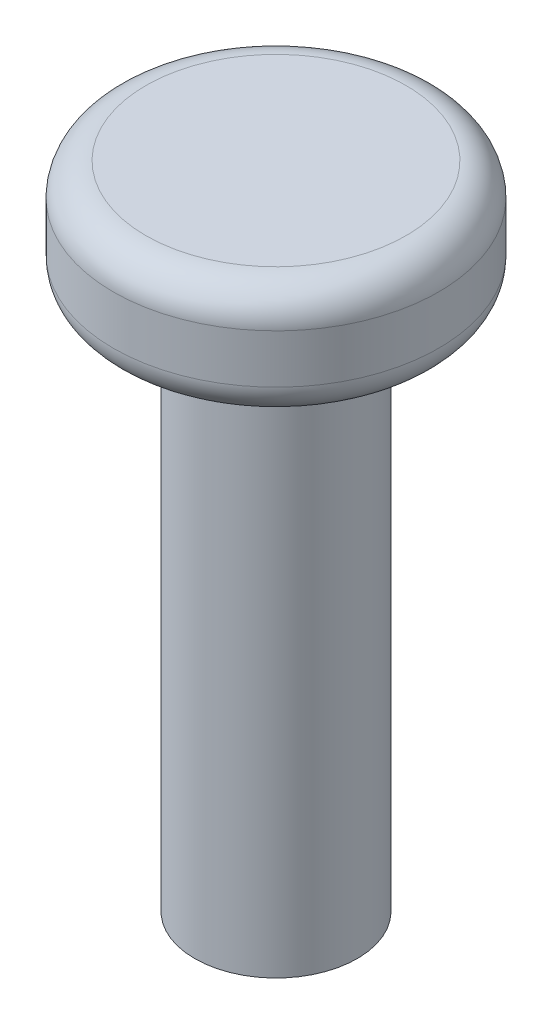
ISO-10303-21;
HEADER;
FILE_DESCRIPTION(('STEP AP214'),'2;1');
FILE_NAME('part.step','',(''),(''),'','','');
FILE_SCHEMA(('AUTOMOTIVE_DESIGN { 1 0 10303 214 1 1 1 1 }'));
ENDSEC;
DATA;
#1=APPLICATION_CONTEXT('core data for automotive mechanical design processes');
#2=APPLICATION_PROTOCOL_DEFINITION('international standard','automotive_design',2000,#1);
#3=PRODUCT_CONTEXT('',#1,'mechanical');
#4=PRODUCT('Part','Part','',(#3));
#5=PRODUCT_RELATED_PRODUCT_CATEGORY('part','',(#4));
#6=PRODUCT_DEFINITION_FORMATION('','',#4);
#7=PRODUCT_DEFINITION_CONTEXT('part definition',#1,'design');
#8=PRODUCT_DEFINITION('design','',#6,#7);
#9=PRODUCT_DEFINITION_SHAPE('','',#8);
#10=(LENGTH_UNIT() NAMED_UNIT(*) SI_UNIT(.MILLI.,.METRE.));
#11=(NAMED_UNIT(*) PLANE_ANGLE_UNIT() SI_UNIT($,.RADIAN.));
#12=(NAMED_UNIT(*) SI_UNIT($,.STERADIAN.) SOLID_ANGLE_UNIT());
#13=UNCERTAINTY_MEASURE_WITH_UNIT(LENGTH_MEASURE(1.E-05),#10,'distance_accuracy_value','');
#14=(GEOMETRIC_REPRESENTATION_CONTEXT(3) GLOBAL_UNCERTAINTY_ASSIGNED_CONTEXT((#13)) GLOBAL_UNIT_ASSIGNED_CONTEXT((#10,
#11,#12)) REPRESENTATION_CONTEXT('',''));
#15=CARTESIAN_POINT('',(0.,0.,0.));
#16=DIRECTION('',(0.,0.,1.));
#17=DIRECTION('',(1.,0.,0.));
#18=AXIS2_PLACEMENT_3D('',#15,#16,#17);
#19=CARTESIAN_POINT('',(0.,10.,0.));
#20=DIRECTION('',(0.,-1.,0.));
#21=DIRECTION('',(0.,0.,-1.));
#22=AXIS2_PLACEMENT_3D('',#19,#20,#21);
#23=CYLINDRICAL_SURFACE('',#22,2.5);
#24=CARTESIAN_POINT('',(0.,-10.,0.));
#25=DIRECTION('',(0.,1.,0.));
#26=DIRECTION('',(0.,0.,1.));
#27=AXIS2_PLACEMENT_3D('',#24,#25,#26);
#28=CIRCLE('',#27,2.5);
#29=CARTESIAN_POINT('',(0.,-10.,2.5));
#30=VERTEX_POINT('',#29);
#31=EDGE_CURVE('E97',#30,#30,#28,.T.);
#32=ORIENTED_EDGE('',*,*,#31,.T.);
#33=EDGE_LOOP('',(#32));
#34=FACE_BOUND('',#33,.T.);
#35=CARTESIAN_POINT('',(0.,6.5,0.));
#36=DIRECTION('',(0.,1.,0.));
#37=DIRECTION('',(0.,0.,1.));
#38=AXIS2_PLACEMENT_3D('',#35,#36,#37);
#39=CIRCLE('',#38,2.5);
#40=CARTESIAN_POINT('',(0.,6.5,2.5));
#41=VERTEX_POINT('',#40);
#42=EDGE_CURVE('E101',#41,#41,#39,.T.);
#43=ORIENTED_EDGE('',*,*,#42,.F.);
#44=EDGE_LOOP('',(#43));
#45=FACE_BOUND('',#44,.T.);
#46=ADVANCED_FACE('F39',(#34,#45),#23,.T.);
#47=CARTESIAN_POINT('',(1.,10.,-0.625));
#48=DIRECTION('',(-1.,0.,0.));
#49=DIRECTION('',(0.,0.,1.));
#50=AXIS2_PLACEMENT_3D('',#47,#48,#49);
#51=PLANE('',#50);
#52=DIRECTION('',(0.,-1.,0.));
#53=VECTOR('',#52,1.);
#54=CARTESIAN_POINT('',(1.,10.,0.625));
#55=LINE('',#54,#53);
#56=CARTESIAN_POINT('',(1.,-6.,0.625));
#57=VERTEX_POINT('',#56);
#58=CARTESIAN_POINT('',(1.,-10.,0.625));
#59=VERTEX_POINT('',#58);
#60=EDGE_CURVE('E61',#57,#59,#55,.T.);
#61=ORIENTED_EDGE('',*,*,#60,.F.);
#62=DIRECTION('',(0.,0.,-1.));
#63=VECTOR('',#62,1.);
#64=CARTESIAN_POINT('',(1.,-6.,0.625));
#65=LINE('',#64,#63);
#66=CARTESIAN_POINT('',(1.,-6.,-0.625));
#67=VERTEX_POINT('',#66);
#68=EDGE_CURVE('E54',#57,#67,#65,.T.);
#69=ORIENTED_EDGE('',*,*,#68,.T.);
#70=DIRECTION('',(0.,-1.,0.));
#71=VECTOR('',#70,1.);
#72=CARTESIAN_POINT('',(1.,10.,-0.625));
#73=LINE('',#72,#71);
#74=CARTESIAN_POINT('',(1.,-10.,-0.625));
#75=VERTEX_POINT('',#74);
#76=EDGE_CURVE('E89',#67,#75,#73,.T.);
#77=ORIENTED_EDGE('',*,*,#76,.T.);
#78=DIRECTION('',(0.,0.,-1.));
#79=VECTOR('',#78,1.);
#80=CARTESIAN_POINT('',(1.,-10.,-0.625));
#81=LINE('',#80,#79);
#82=EDGE_CURVE('E251',#59,#75,#81,.T.);
#83=ORIENTED_EDGE('',*,*,#82,.F.);
#84=EDGE_LOOP('',(#61,#69,#77,#83));
#85=FACE_BOUND('',#84,.T.);
#86=ADVANCED_FACE('F88',(#85),#51,.T.);
#87=CARTESIAN_POINT('',(-1.,10.,-0.625));
#88=DIRECTION('',(0.,0.,1.));
#89=DIRECTION('',(1.,0.,0.));
#90=AXIS2_PLACEMENT_3D('',#87,#88,#89);
#91=PLANE('',#90);
#92=ORIENTED_EDGE('',*,*,#76,.F.);
#93=DIRECTION('',(-1.,0.,0.));
#94=VECTOR('',#93,1.);
#95=CARTESIAN_POINT('',(1.,-6.,-0.625));
#96=LINE('',#95,#94);
#97=CARTESIAN_POINT('',(-1.,-6.,-0.625));
#98=VERTEX_POINT('',#97);
#99=EDGE_CURVE('E79',#67,#98,#96,.T.);
#100=ORIENTED_EDGE('',*,*,#99,.T.);
#101=DIRECTION('',(0.,-1.,0.));
#102=VECTOR('',#101,1.);
#103=CARTESIAN_POINT('',(-1.,10.,-0.625));
#104=LINE('',#103,#102);
#105=CARTESIAN_POINT('',(-1.,-10.,-0.625));
#106=VERTEX_POINT('',#105);
#107=EDGE_CURVE('E98',#98,#106,#104,.T.);
#108=ORIENTED_EDGE('',*,*,#107,.T.);
#109=DIRECTION('',(-1.,0.,0.));
#110=VECTOR('',#109,1.);
#111=CARTESIAN_POINT('',(-1.,-10.,-0.625));
#112=LINE('',#111,#110);
#113=EDGE_CURVE('E95',#75,#106,#112,.T.);
#114=ORIENTED_EDGE('',*,*,#113,.F.);
#115=EDGE_LOOP('',(#92,#100,#108,#114));
#116=FACE_BOUND('',#115,.T.);
#117=ADVANCED_FACE('F93',(#116),#91,.T.);
#118=CARTESIAN_POINT('',(-1.,10.,-0.625));
#119=DIRECTION('',(1.,0.,0.));
#120=DIRECTION('',(0.,0.,-1.));
#121=AXIS2_PLACEMENT_3D('',#118,#119,#120);
#122=PLANE('',#121);
#123=ORIENTED_EDGE('',*,*,#107,.F.);
#124=DIRECTION('',(0.,0.,1.));
#125=VECTOR('',#124,1.);
#126=CARTESIAN_POINT('',(-1.,-6.,-0.625));
#127=LINE('',#126,#125);
#128=CARTESIAN_POINT('',(-1.,-6.,0.625));
#129=VERTEX_POINT('',#128);
#130=EDGE_CURVE('E82',#98,#129,#127,.T.);
#131=ORIENTED_EDGE('',*,*,#130,.T.);
#132=DIRECTION('',(0.,-1.,0.));
#133=VECTOR('',#132,1.);
#134=CARTESIAN_POINT('',(-1.,10.,0.625));
#135=LINE('',#134,#133);
#136=CARTESIAN_POINT('',(-1.,-10.,0.625));
#137=VERTEX_POINT('',#136);
#138=EDGE_CURVE('E103',#129,#137,#135,.T.);
#139=ORIENTED_EDGE('',*,*,#138,.T.);
#140=DIRECTION('',(0.,0.,1.));
#141=VECTOR('',#140,1.);
#142=CARTESIAN_POINT('',(-1.,-10.,-0.625));
#143=LINE('',#142,#141);
#144=EDGE_CURVE('E248',#106,#137,#143,.T.);
#145=ORIENTED_EDGE('',*,*,#144,.F.);
#146=EDGE_LOOP('',(#123,#131,#139,#145));
#147=FACE_BOUND('',#146,.T.);
#148=ADVANCED_FACE('F148',(#147),#122,.T.);
#149=CARTESIAN_POINT('',(-1.,10.,0.625));
#150=DIRECTION('',(0.,0.,-1.));
#151=DIRECTION('',(-1.,0.,0.));
#152=AXIS2_PLACEMENT_3D('',#149,#150,#151);
#153=PLANE('',#152);
#154=ORIENTED_EDGE('',*,*,#138,.F.);
#155=DIRECTION('',(1.,0.,0.));
#156=VECTOR('',#155,1.);
#157=CARTESIAN_POINT('',(-1.,-6.,0.625));
#158=LINE('',#157,#156);
#159=EDGE_CURVE('E91',#129,#57,#158,.T.);
#160=ORIENTED_EDGE('',*,*,#159,.T.);
#161=ORIENTED_EDGE('',*,*,#60,.T.);
#162=DIRECTION('',(1.,0.,0.));
#163=VECTOR('',#162,1.);
#164=CARTESIAN_POINT('',(-1.,-10.,0.625));
#165=LINE('',#164,#163);
#166=EDGE_CURVE('E242',#137,#59,#165,.T.);
#167=ORIENTED_EDGE('',*,*,#166,.F.);
#168=EDGE_LOOP('',(#154,#160,#161,#167));
#169=FACE_BOUND('',#168,.T.);
#170=ADVANCED_FACE('F142',(#169),#153,.T.);
#171=CARTESIAN_POINT('',(0.,-10.,0.));
#172=DIRECTION('',(0.,1.,0.));
#173=DIRECTION('',(0.,0.,1.));
#174=AXIS2_PLACEMENT_3D('',#171,#172,#173);
#175=PLANE('',#174);
#176=ORIENTED_EDGE('',*,*,#31,.F.);
#177=EDGE_LOOP('',(#176));
#178=FACE_BOUND('',#177,.T.);
#179=ORIENTED_EDGE('',*,*,#82,.T.);
#180=ORIENTED_EDGE('',*,*,#113,.T.);
#181=ORIENTED_EDGE('',*,*,#144,.T.);
#182=ORIENTED_EDGE('',*,*,#166,.T.);
#183=EDGE_LOOP('',(#179,#180,#181,#182));
#184=FACE_BOUND('',#183,.T.);
#185=ADVANCED_FACE('F139',(#178,#184),#175,.F.);
#186=CARTESIAN_POINT('',(0.,-6.,0.));
#187=DIRECTION('',(0.,1.,0.));
#188=DIRECTION('',(0.,0.,1.));
#189=AXIS2_PLACEMENT_3D('',#186,#187,#188);
#190=PLANE('',#189);
#191=ORIENTED_EDGE('',*,*,#159,.F.);
#192=ORIENTED_EDGE('',*,*,#130,.F.);
#193=ORIENTED_EDGE('',*,*,#99,.F.);
#194=ORIENTED_EDGE('',*,*,#68,.F.);
#195=EDGE_LOOP('',(#191,#192,#193,#194));
#196=FACE_BOUND('',#195,.T.);
#197=ADVANCED_FACE('F80',(#196),#190,.F.);
#198=CARTESIAN_POINT('',(0.,6.5,0.));
#199=DIRECTION('',(0.,1.,0.));
#200=DIRECTION('',(0.,0.,1.));
#201=AXIS2_PLACEMENT_3D('',#198,#199,#200);
#202=CYLINDRICAL_SURFACE('',#201,5.);
#203=CARTESIAN_POINT('',(0.,9.,0.));
#204=DIRECTION('',(0.,1.,0.));
#205=DIRECTION('',(0.,0.,1.));
#206=AXIS2_PLACEMENT_3D('',#203,#204,#205);
#207=CIRCLE('',#206,5.);
#208=CARTESIAN_POINT('',(0.,9.,5.));
#209=VERTEX_POINT('',#208);
#210=EDGE_CURVE('E11',#209,#209,#207,.F.);
#211=ORIENTED_EDGE('',*,*,#210,.T.);
#212=EDGE_LOOP('',(#211));
#213=FACE_BOUND('',#212,.T.);
#214=CARTESIAN_POINT('',(0.,7.5,0.));
#215=DIRECTION('',(0.,1.,0.));
#216=DIRECTION('',(0.,0.,1.));
#217=AXIS2_PLACEMENT_3D('',#214,#215,#216);
#218=CIRCLE('',#217,5.);
#219=CARTESIAN_POINT('',(0.,7.5,5.));
#220=VERTEX_POINT('',#219);
#221=EDGE_CURVE('E109',#220,#220,#218,.T.);
#222=ORIENTED_EDGE('',*,*,#221,.T.);
#223=EDGE_LOOP('',(#222));
#224=FACE_BOUND('',#223,.T.);
#225=ADVANCED_FACE('F155',(#213,#224),#202,.T.);
#226=CARTESIAN_POINT('',(0.,6.5,0.));
#227=DIRECTION('',(0.,1.,0.));
#228=DIRECTION('',(0.,0.,1.));
#229=AXIS2_PLACEMENT_3D('',#226,#227,#228);
#230=PLANE('',#229);
#231=CARTESIAN_POINT('',(0.,6.5,0.));
#232=DIRECTION('',(0.,1.,0.));
#233=DIRECTION('',(0.,0.,1.));
#234=AXIS2_PLACEMENT_3D('',#231,#232,#233);
#235=CIRCLE('',#234,4.);
#236=CARTESIAN_POINT('',(0.,6.5,4.));
#237=VERTEX_POINT('',#236);
#238=EDGE_CURVE('E112',#237,#237,#235,.F.);
#239=ORIENTED_EDGE('',*,*,#238,.T.);
#240=EDGE_LOOP('',(#239));
#241=FACE_BOUND('',#240,.T.);
#242=ORIENTED_EDGE('',*,*,#42,.T.);
#243=EDGE_LOOP('',(#242));
#244=FACE_BOUND('',#243,.T.);
#245=ADVANCED_FACE('F144',(#241,#244),#230,.F.);
#246=CARTESIAN_POINT('',(0.,10.,0.));
#247=DIRECTION('',(0.,1.,0.));
#248=DIRECTION('',(0.,0.,1.));
#249=AXIS2_PLACEMENT_3D('',#246,#247,#248);
#250=PLANE('',#249);
#251=CARTESIAN_POINT('',(0.,10.,0.));
#252=DIRECTION('',(0.,1.,0.));
#253=DIRECTION('',(0.,0.,1.));
#254=AXIS2_PLACEMENT_3D('',#251,#252,#253);
#255=CIRCLE('',#254,4.);
#256=CARTESIAN_POINT('',(0.,10.,4.));
#257=VERTEX_POINT('',#256);
#258=EDGE_CURVE('E47',#257,#257,#255,.T.);
#259=ORIENTED_EDGE('',*,*,#258,.T.);
#260=EDGE_LOOP('',(#259));
#261=FACE_BOUND('',#260,.T.);
#262=ADVANCED_FACE('F117',(#261),#250,.T.);
#263=CARTESIAN_POINT('',(0.,7.5,0.));
#264=DIRECTION('',(0.,1.,0.));
#265=DIRECTION('',(0.,0.,1.));
#266=AXIS2_PLACEMENT_3D('',#263,#264,#265);
#267=TOROIDAL_SURFACE('',#266,4.,1.);
#268=ORIENTED_EDGE('',*,*,#238,.F.);
#269=EDGE_LOOP('',(#268));
#270=FACE_BOUND('',#269,.T.);
#271=ORIENTED_EDGE('',*,*,#221,.F.);
#272=EDGE_LOOP('',(#271));
#273=FACE_BOUND('',#272,.T.);
#274=ADVANCED_FACE('F120',(#270,#273),#267,.T.);
#275=CARTESIAN_POINT('',(0.,9.,0.));
#276=DIRECTION('',(0.,1.,0.));
#277=DIRECTION('',(0.,0.,1.));
#278=AXIS2_PLACEMENT_3D('',#275,#276,#277);
#279=TOROIDAL_SURFACE('',#278,4.,1.);
#280=ORIENTED_EDGE('',*,*,#210,.F.);
#281=EDGE_LOOP('',(#280));
#282=FACE_BOUND('',#281,.T.);
#283=ORIENTED_EDGE('',*,*,#258,.F.);
#284=EDGE_LOOP('',(#283));
#285=FACE_BOUND('',#284,.T.);
#286=ADVANCED_FACE('F41',(#282,#285),#279,.T.);
#287=CLOSED_SHELL('',(#46,#86,#117,#148,#170,#185,#197,#225,#245,#262,#274,#286));
#288=MANIFOLD_SOLID_BREP('B2',#287);
#289=ADVANCED_BREP_SHAPE_REPRESENTATION('',(#18,#288),#14);
#290=SHAPE_DEFINITION_REPRESENTATION(#9,#289);
ENDSEC;
END-ISO-10303-21;
